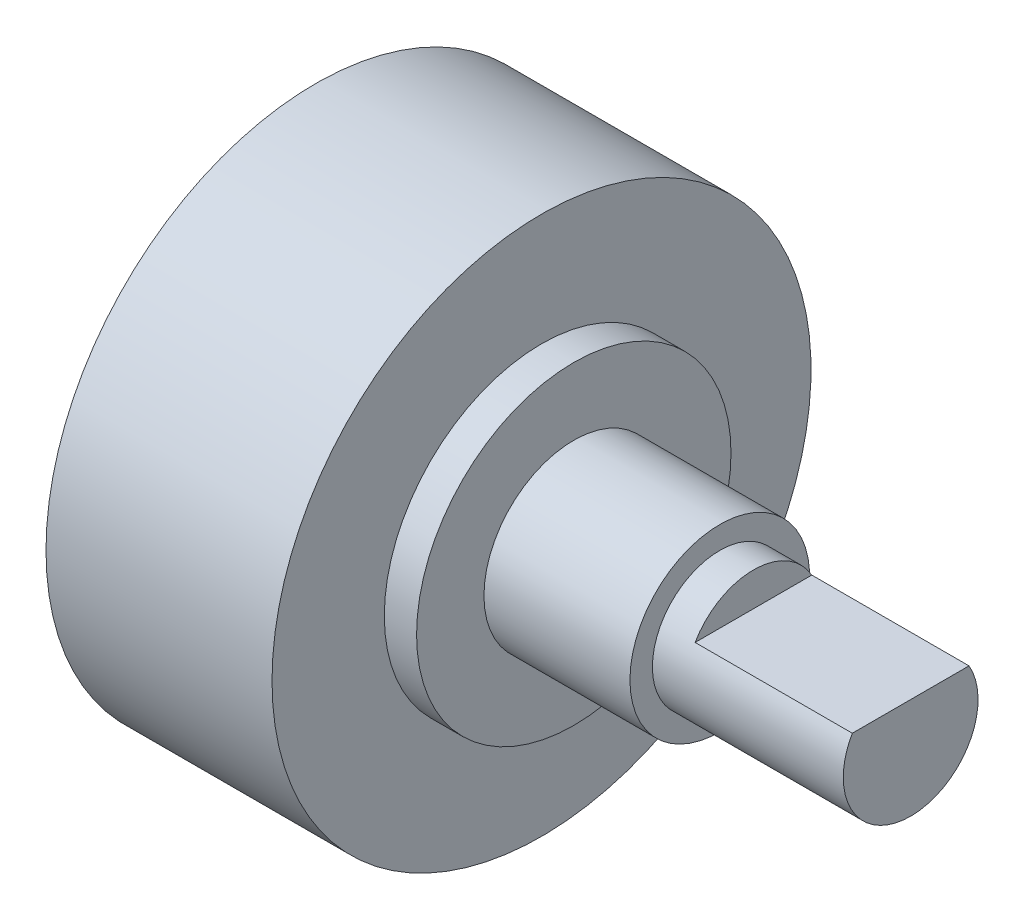
ISO-10303-21;
HEADER;
FILE_DESCRIPTION(('STEP AP214'),'2;1');
FILE_NAME('part.step','',(''),(''),'','','');
FILE_SCHEMA(('AUTOMOTIVE_DESIGN { 1 0 10303 214 1 1 1 1 }'));
ENDSEC;
DATA;
#1=APPLICATION_CONTEXT('core data for automotive mechanical design processes');
#2=APPLICATION_PROTOCOL_DEFINITION('international standard','automotive_design',2000,#1);
#3=PRODUCT_CONTEXT('',#1,'mechanical');
#4=PRODUCT('Part','Part','',(#3));
#5=PRODUCT_RELATED_PRODUCT_CATEGORY('part','',(#4));
#6=PRODUCT_DEFINITION_FORMATION('','',#4);
#7=PRODUCT_DEFINITION_CONTEXT('part definition',#1,'design');
#8=PRODUCT_DEFINITION('design','',#6,#7);
#9=PRODUCT_DEFINITION_SHAPE('','',#8);
#10=(LENGTH_UNIT() NAMED_UNIT(*) SI_UNIT(.MILLI.,.METRE.));
#11=(NAMED_UNIT(*) PLANE_ANGLE_UNIT() SI_UNIT($,.RADIAN.));
#12=(NAMED_UNIT(*) SI_UNIT($,.STERADIAN.) SOLID_ANGLE_UNIT());
#13=UNCERTAINTY_MEASURE_WITH_UNIT(LENGTH_MEASURE(1.E-05),#10,'distance_accuracy_value','');
#14=(GEOMETRIC_REPRESENTATION_CONTEXT(3) GLOBAL_UNCERTAINTY_ASSIGNED_CONTEXT((#13)) GLOBAL_UNIT_ASSIGNED_CONTEXT((#10,
#11,#12)) REPRESENTATION_CONTEXT('',''));
#15=CARTESIAN_POINT('',(0.,0.,0.));
#16=DIRECTION('',(0.,0.,1.));
#17=DIRECTION('',(1.,0.,0.));
#18=AXIS2_PLACEMENT_3D('',#15,#16,#17);
#19=CARTESIAN_POINT('',(0.,12.,0.));
#20=DIRECTION('',(1.,0.,0.));
#21=DIRECTION('',(0.,0.,-1.));
#22=AXIS2_PLACEMENT_3D('',#19,#20,#21);
#23=PLANE('',#22);
#24=CARTESIAN_POINT('',(0.,0.,0.));
#25=DIRECTION('',(-1.,0.,0.));
#26=DIRECTION('',(0.,0.,1.));
#27=AXIS2_PLACEMENT_3D('',#24,#25,#26);
#28=CIRCLE('',#27,12.);
#29=CARTESIAN_POINT('',(0.,0.,12.));
#30=VERTEX_POINT('',#29);
#31=EDGE_CURVE('E71',#30,#30,#28,.T.);
#32=ORIENTED_EDGE('',*,*,#31,.T.);
#33=EDGE_LOOP('',(#32));
#34=FACE_BOUND('',#33,.T.);
#35=ADVANCED_FACE('F32',(#34),#23,.F.);
#36=CARTESIAN_POINT('',(26.5,0.,0.));
#37=DIRECTION('',(-1.,0.,0.));
#38=DIRECTION('',(0.,0.,1.));
#39=AXIS2_PLACEMENT_3D('',#36,#37,#38);
#40=PLANE('',#39);
#41=CARTESIAN_POINT('',(26.5,0.,0.));
#42=DIRECTION('',(-1.,0.,0.));
#43=DIRECTION('',(0.,0.,1.));
#44=AXIS2_PLACEMENT_3D('',#41,#42,#43);
#45=CIRCLE('',#44,3.);
#46=CARTESIAN_POINT('',(26.5,1.5,-2.59807621135332));
#47=VERTEX_POINT('',#46);
#48=CARTESIAN_POINT('',(26.5,1.5,2.59807621135332));
#49=VERTEX_POINT('',#48);
#50=EDGE_CURVE('E11',#47,#49,#45,.T.);
#51=ORIENTED_EDGE('',*,*,#50,.F.);
#52=DIRECTION('',(0.,0.,-1.));
#53=VECTOR('',#52,1.);
#54=CARTESIAN_POINT('',(26.5,1.5,2.59807621135332));
#55=LINE('',#54,#53);
#56=EDGE_CURVE('E60',#49,#47,#55,.T.);
#57=ORIENTED_EDGE('',*,*,#56,.F.);
#58=EDGE_LOOP('',(#51,#57));
#59=FACE_BOUND('',#58,.T.);
#60=ADVANCED_FACE('F67',(#59),#40,.F.);
#61=CARTESIAN_POINT('',(0.,0.,0.));
#62=DIRECTION('',(-1.,0.,0.));
#63=DIRECTION('',(0.,0.,1.));
#64=AXIS2_PLACEMENT_3D('',#61,#62,#63);
#65=CYLINDRICAL_SURFACE('',#64,3.);
#66=ORIENTED_EDGE('',*,*,#50,.T.);
#67=DIRECTION('',(1.,0.,0.));
#68=VECTOR('',#67,1.);
#69=CARTESIAN_POINT('',(19.5,1.5,2.59807621135332));
#70=LINE('',#69,#68);
#71=CARTESIAN_POINT('',(19.5,1.5,2.59807621135332));
#72=VERTEX_POINT('',#71);
#73=EDGE_CURVE('E57',#72,#49,#70,.T.);
#74=ORIENTED_EDGE('',*,*,#73,.F.);
#75=CARTESIAN_POINT('',(19.5,0.,0.));
#76=DIRECTION('',(1.,0.,0.));
#77=DIRECTION('',(0.,0.,1.));
#78=AXIS2_PLACEMENT_3D('',#75,#76,#77);
#79=CIRCLE('',#78,3.);
#80=CARTESIAN_POINT('',(19.5,1.5,-2.59807621135332));
#81=VERTEX_POINT('',#80);
#82=EDGE_CURVE('E50',#81,#72,#79,.T.);
#83=ORIENTED_EDGE('',*,*,#82,.F.);
#84=DIRECTION('',(1.,0.,0.));
#85=VECTOR('',#84,1.);
#86=CARTESIAN_POINT('',(19.5,1.5,-2.59807621135332));
#87=LINE('',#86,#85);
#88=EDGE_CURVE('E63',#81,#47,#87,.T.);
#89=ORIENTED_EDGE('',*,*,#88,.T.);
#90=EDGE_LOOP('',(#66,#74,#83,#89));
#91=FACE_BOUND('',#90,.T.);
#92=CARTESIAN_POINT('',(18.,0.,0.));
#93=DIRECTION('',(-1.,0.,0.));
#94=DIRECTION('',(0.,0.,1.));
#95=AXIS2_PLACEMENT_3D('',#92,#93,#94);
#96=CIRCLE('',#95,3.);
#97=CARTESIAN_POINT('',(18.,0.,3.));
#98=VERTEX_POINT('',#97);
#99=EDGE_CURVE('E39',#98,#98,#96,.T.);
#100=ORIENTED_EDGE('',*,*,#99,.F.);
#101=EDGE_LOOP('',(#100));
#102=FACE_BOUND('',#101,.T.);
#103=ADVANCED_FACE('F69',(#91,#102),#65,.T.);
#104=CARTESIAN_POINT('',(18.,3.,0.));
#105=DIRECTION('',(-1.,0.,0.));
#106=DIRECTION('',(0.,0.,1.));
#107=AXIS2_PLACEMENT_3D('',#104,#105,#106);
#108=PLANE('',#107);
#109=CARTESIAN_POINT('',(18.,0.,0.));
#110=DIRECTION('',(-1.,0.,0.));
#111=DIRECTION('',(0.,0.,1.));
#112=AXIS2_PLACEMENT_3D('',#109,#110,#111);
#113=CIRCLE('',#112,4.00000000000001);
#114=CARTESIAN_POINT('',(18.,0.,4.00000000000001));
#115=VERTEX_POINT('',#114);
#116=EDGE_CURVE('E89',#115,#115,#113,.T.);
#117=ORIENTED_EDGE('',*,*,#116,.F.);
#118=EDGE_LOOP('',(#117));
#119=FACE_BOUND('',#118,.T.);
#120=ORIENTED_EDGE('',*,*,#99,.T.);
#121=EDGE_LOOP('',(#120));
#122=FACE_BOUND('',#121,.T.);
#123=ADVANCED_FACE('F94',(#119,#122),#108,.F.);
#124=CARTESIAN_POINT('',(0.,0.,0.));
#125=DIRECTION('',(-1.,0.,0.));
#126=DIRECTION('',(0.,0.,1.));
#127=AXIS2_PLACEMENT_3D('',#124,#125,#126);
#128=CYLINDRICAL_SURFACE('',#127,4.00000000000001);
#129=CARTESIAN_POINT('',(11.5,0.,0.));
#130=DIRECTION('',(-1.,0.,0.));
#131=DIRECTION('',(0.,0.,1.));
#132=AXIS2_PLACEMENT_3D('',#129,#130,#131);
#133=CIRCLE('',#132,4.00000000000001);
#134=CARTESIAN_POINT('',(11.5,0.,4.00000000000001));
#135=VERTEX_POINT('',#134);
#136=EDGE_CURVE('E86',#135,#135,#133,.T.);
#137=ORIENTED_EDGE('',*,*,#136,.F.);
#138=EDGE_LOOP('',(#137));
#139=FACE_BOUND('',#138,.T.);
#140=ORIENTED_EDGE('',*,*,#116,.T.);
#141=EDGE_LOOP('',(#140));
#142=FACE_BOUND('',#141,.T.);
#143=ADVANCED_FACE('F101',(#139,#142),#128,.T.);
#144=CARTESIAN_POINT('',(11.5,4.00000000000001,0.));
#145=DIRECTION('',(-1.,0.,0.));
#146=DIRECTION('',(0.,0.,1.));
#147=AXIS2_PLACEMENT_3D('',#144,#145,#146);
#148=PLANE('',#147);
#149=CARTESIAN_POINT('',(11.5,0.,0.));
#150=DIRECTION('',(-1.,0.,0.));
#151=DIRECTION('',(0.,0.,1.));
#152=AXIS2_PLACEMENT_3D('',#149,#150,#151);
#153=CIRCLE('',#152,7.);
#154=CARTESIAN_POINT('',(11.5,0.,7.));
#155=VERTEX_POINT('',#154);
#156=EDGE_CURVE('E83',#155,#155,#153,.T.);
#157=ORIENTED_EDGE('',*,*,#156,.F.);
#158=EDGE_LOOP('',(#157));
#159=FACE_BOUND('',#158,.T.);
#160=ORIENTED_EDGE('',*,*,#136,.T.);
#161=EDGE_LOOP('',(#160));
#162=FACE_BOUND('',#161,.T.);
#163=ADVANCED_FACE('F125',(#159,#162),#148,.F.);
#164=CARTESIAN_POINT('',(0.,0.,0.));
#165=DIRECTION('',(-1.,0.,0.));
#166=DIRECTION('',(0.,0.,1.));
#167=AXIS2_PLACEMENT_3D('',#164,#165,#166);
#168=CYLINDRICAL_SURFACE('',#167,7.);
#169=CARTESIAN_POINT('',(10.0631187714875,0.,0.));
#170=DIRECTION('',(-1.,0.,0.));
#171=DIRECTION('',(0.,0.,1.));
#172=AXIS2_PLACEMENT_3D('',#169,#170,#171);
#173=CIRCLE('',#172,7.);
#174=CARTESIAN_POINT('',(10.0631187714875,0.,7.));
#175=VERTEX_POINT('',#174);
#176=EDGE_CURVE('E80',#175,#175,#173,.T.);
#177=ORIENTED_EDGE('',*,*,#176,.F.);
#178=EDGE_LOOP('',(#177));
#179=FACE_BOUND('',#178,.T.);
#180=ORIENTED_EDGE('',*,*,#156,.T.);
#181=EDGE_LOOP('',(#180));
#182=FACE_BOUND('',#181,.T.);
#183=ADVANCED_FACE('F119',(#179,#182),#168,.T.);
#184=CARTESIAN_POINT('',(10.0631187714875,7.,0.));
#185=DIRECTION('',(-1.,0.,0.));
#186=DIRECTION('',(0.,0.,1.));
#187=AXIS2_PLACEMENT_3D('',#184,#185,#186);
#188=PLANE('',#187);
#189=CARTESIAN_POINT('',(10.0631187714875,0.,0.));
#190=DIRECTION('',(-1.,0.,0.));
#191=DIRECTION('',(0.,0.,1.));
#192=AXIS2_PLACEMENT_3D('',#189,#190,#191);
#193=CIRCLE('',#192,12.);
#194=CARTESIAN_POINT('',(10.0631187714875,0.,12.));
#195=VERTEX_POINT('',#194);
#196=EDGE_CURVE('E74',#195,#195,#193,.T.);
#197=ORIENTED_EDGE('',*,*,#196,.F.);
#198=EDGE_LOOP('',(#197));
#199=FACE_BOUND('',#198,.T.);
#200=ORIENTED_EDGE('',*,*,#176,.T.);
#201=EDGE_LOOP('',(#200));
#202=FACE_BOUND('',#201,.T.);
#203=ADVANCED_FACE('F113',(#199,#202),#188,.F.);
#204=CARTESIAN_POINT('',(0.,0.,0.));
#205=DIRECTION('',(-1.,0.,0.));
#206=DIRECTION('',(0.,0.,1.));
#207=AXIS2_PLACEMENT_3D('',#204,#205,#206);
#208=CYLINDRICAL_SURFACE('',#207,12.);
#209=ORIENTED_EDGE('',*,*,#31,.F.);
#210=EDGE_LOOP('',(#209));
#211=FACE_BOUND('',#210,.T.);
#212=ORIENTED_EDGE('',*,*,#196,.T.);
#213=EDGE_LOOP('',(#212));
#214=FACE_BOUND('',#213,.T.);
#215=ADVANCED_FACE('F110',(#211,#214),#208,.T.);
#216=CARTESIAN_POINT('',(19.5,1.5,2.59807621135332));
#217=DIRECTION('',(0.,-1.,0.));
#218=DIRECTION('',(0.,0.,-1.));
#219=AXIS2_PLACEMENT_3D('',#216,#217,#218);
#220=PLANE('',#219);
#221=ORIENTED_EDGE('',*,*,#56,.T.);
#222=ORIENTED_EDGE('',*,*,#88,.F.);
#223=DIRECTION('',(0.,0.,-1.));
#224=VECTOR('',#223,1.);
#225=CARTESIAN_POINT('',(19.5,1.5,2.59807621135332));
#226=LINE('',#225,#224);
#227=EDGE_CURVE('E45',#72,#81,#226,.T.);
#228=ORIENTED_EDGE('',*,*,#227,.F.);
#229=ORIENTED_EDGE('',*,*,#73,.T.);
#230=EDGE_LOOP('',(#221,#222,#228,#229));
#231=FACE_BOUND('',#230,.T.);
#232=ADVANCED_FACE('F59',(#231),#220,.F.);
#233=CARTESIAN_POINT('',(19.5,0.,0.));
#234=DIRECTION('',(-1.,0.,0.));
#235=DIRECTION('',(0.,0.,1.));
#236=AXIS2_PLACEMENT_3D('',#233,#234,#235);
#237=PLANE('',#236);
#238=ORIENTED_EDGE('',*,*,#82,.T.);
#239=ORIENTED_EDGE('',*,*,#227,.T.);
#240=EDGE_LOOP('',(#238,#239));
#241=FACE_BOUND('',#240,.T.);
#242=ADVANCED_FACE('F143',(#241),#237,.F.);
#243=CLOSED_SHELL('',(#35,#60,#103,#123,#143,#163,#183,#203,#215,#232,#242));
#244=MANIFOLD_SOLID_BREP('B2',#243);
#245=ADVANCED_BREP_SHAPE_REPRESENTATION('',(#18,#244),#14);
#246=SHAPE_DEFINITION_REPRESENTATION(#9,#245);
ENDSEC;
END-ISO-10303-21;
